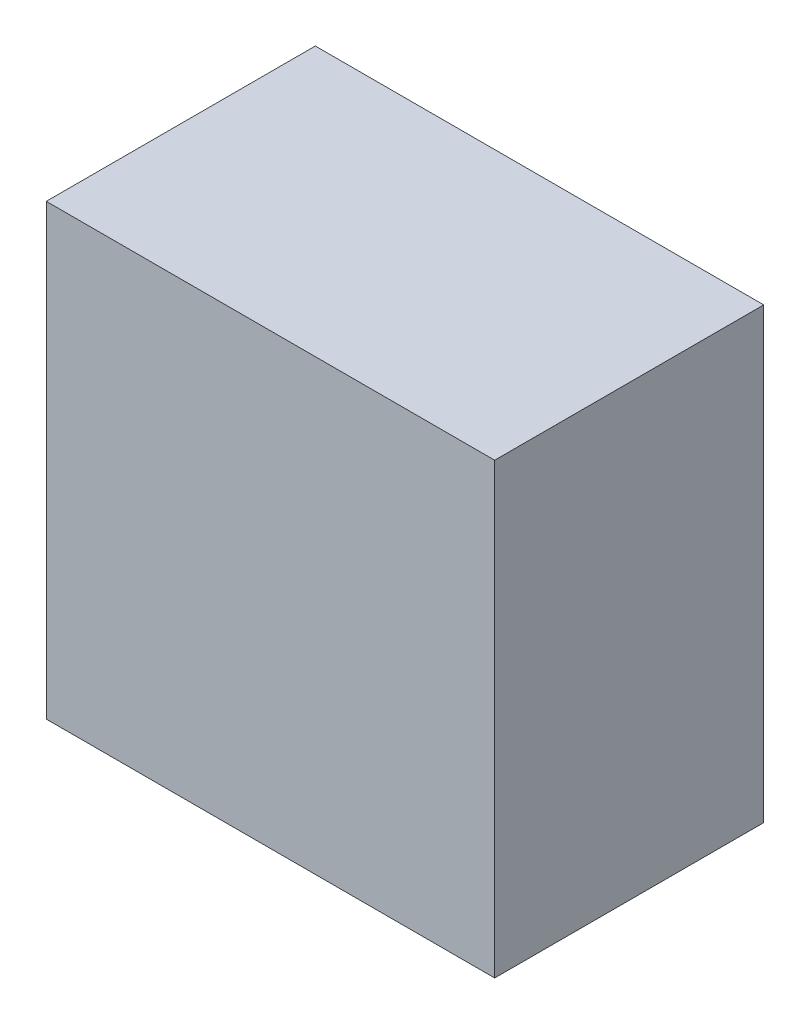
ISO-10303-21;
HEADER;
FILE_DESCRIPTION(('STEP AP214'),'2;1');
FILE_NAME('part.step','',(''),(''),'','','');
FILE_SCHEMA(('AUTOMOTIVE_DESIGN { 1 0 10303 214 1 1 1 1 }'));
ENDSEC;
DATA;
#1=APPLICATION_CONTEXT('core data for automotive mechanical design processes');
#2=APPLICATION_PROTOCOL_DEFINITION('international standard','automotive_design',2000,#1);
#3=PRODUCT_CONTEXT('',#1,'mechanical');
#4=PRODUCT('Part','Part','',(#3));
#5=PRODUCT_RELATED_PRODUCT_CATEGORY('part','',(#4));
#6=PRODUCT_DEFINITION_FORMATION('','',#4);
#7=PRODUCT_DEFINITION_CONTEXT('part definition',#1,'design');
#8=PRODUCT_DEFINITION('design','',#6,#7);
#9=PRODUCT_DEFINITION_SHAPE('','',#8);
#10=(LENGTH_UNIT() NAMED_UNIT(*) SI_UNIT(.MILLI.,.METRE.));
#11=(NAMED_UNIT(*) PLANE_ANGLE_UNIT() SI_UNIT($,.RADIAN.));
#12=(NAMED_UNIT(*) SI_UNIT($,.STERADIAN.) SOLID_ANGLE_UNIT());
#13=UNCERTAINTY_MEASURE_WITH_UNIT(LENGTH_MEASURE(1.E-05),#10,'distance_accuracy_value','');
#14=(GEOMETRIC_REPRESENTATION_CONTEXT(3) GLOBAL_UNCERTAINTY_ASSIGNED_CONTEXT((#13)) GLOBAL_UNIT_ASSIGNED_CONTEXT((#10,
#11,#12)) REPRESENTATION_CONTEXT('',''));
#15=CARTESIAN_POINT('',(0.,0.,0.));
#16=DIRECTION('',(0.,0.,1.));
#17=DIRECTION('',(1.,0.,0.));
#18=AXIS2_PLACEMENT_3D('',#15,#16,#17);
#19=CARTESIAN_POINT('',(0.,0.,0.17999964));
#20=DIRECTION('',(0.,0.,1.));
#21=DIRECTION('',(1.,0.,0.));
#22=AXIS2_PLACEMENT_3D('',#19,#20,#21);
#23=PLANE('',#22);
#24=DIRECTION('',(-1.,0.,0.));
#25=VECTOR('',#24,1.);
#26=CARTESIAN_POINT('',(0.1499997,0.1499997,0.17999964));
#27=LINE('',#26,#25);
#28=CARTESIAN_POINT('',(0.1499997,0.1499997,0.17999964));
#29=VERTEX_POINT('',#28);
#30=CARTESIAN_POINT('',(-0.1499997,0.1499997,0.17999964));
#31=VERTEX_POINT('',#30);
#32=EDGE_CURVE('E86',#29,#31,#27,.T.);
#33=ORIENTED_EDGE('',*,*,#32,.T.);
#34=DIRECTION('',(0.,-1.,0.));
#35=VECTOR('',#34,1.);
#36=CARTESIAN_POINT('',(-0.1499997,0.1499997,0.17999964));
#37=LINE('',#36,#35);
#38=CARTESIAN_POINT('',(-0.1499997,-0.1499997,0.17999964));
#39=VERTEX_POINT('',#38);
#40=EDGE_CURVE('E20',#31,#39,#37,.T.);
#41=ORIENTED_EDGE('',*,*,#40,.T.);
#42=DIRECTION('',(1.,0.,0.));
#43=VECTOR('',#42,1.);
#44=CARTESIAN_POINT('',(-0.1499997,-0.1499997,0.17999964));
#45=LINE('',#44,#43);
#46=CARTESIAN_POINT('',(0.1499997,-0.1499997,0.17999964));
#47=VERTEX_POINT('',#46);
#48=EDGE_CURVE('E77',#39,#47,#45,.T.);
#49=ORIENTED_EDGE('',*,*,#48,.T.);
#50=DIRECTION('',(0.,1.,0.));
#51=VECTOR('',#50,1.);
#52=CARTESIAN_POINT('',(0.1499997,-0.1499997,0.17999964));
#53=LINE('',#52,#51);
#54=EDGE_CURVE('E11',#47,#29,#53,.T.);
#55=ORIENTED_EDGE('',*,*,#54,.T.);
#56=EDGE_LOOP('',(#33,#41,#49,#55));
#57=FACE_BOUND('',#56,.T.);
#58=ADVANCED_FACE('F16',(#57),#23,.T.);
#59=CARTESIAN_POINT('',(0.,0.,0.));
#60=DIRECTION('',(0.,0.,1.));
#61=DIRECTION('',(1.,0.,0.));
#62=AXIS2_PLACEMENT_3D('',#59,#60,#61);
#63=PLANE('',#62);
#64=DIRECTION('',(-1.,0.,0.));
#65=VECTOR('',#64,1.);
#66=CARTESIAN_POINT('',(0.1499997,0.1499997,0.));
#67=LINE('',#66,#65);
#68=CARTESIAN_POINT('',(0.1499997,0.1499997,0.));
#69=VERTEX_POINT('',#68);
#70=CARTESIAN_POINT('',(-0.1499997,0.1499997,0.));
#71=VERTEX_POINT('',#70);
#72=EDGE_CURVE('E105',#69,#71,#67,.T.);
#73=ORIENTED_EDGE('',*,*,#72,.F.);
#74=DIRECTION('',(0.,1.,0.));
#75=VECTOR('',#74,1.);
#76=CARTESIAN_POINT('',(0.1499997,-0.1499997,0.));
#77=LINE('',#76,#75);
#78=CARTESIAN_POINT('',(0.1499997,-0.1499997,0.));
#79=VERTEX_POINT('',#78);
#80=EDGE_CURVE('E27',#79,#69,#77,.T.);
#81=ORIENTED_EDGE('',*,*,#80,.F.);
#82=DIRECTION('',(1.,0.,0.));
#83=VECTOR('',#82,1.);
#84=CARTESIAN_POINT('',(-0.1499997,-0.1499997,0.));
#85=LINE('',#84,#83);
#86=CARTESIAN_POINT('',(-0.1499997,-0.1499997,0.));
#87=VERTEX_POINT('',#86);
#88=EDGE_CURVE('E90',#87,#79,#85,.T.);
#89=ORIENTED_EDGE('',*,*,#88,.F.);
#90=DIRECTION('',(0.,-1.,0.));
#91=VECTOR('',#90,1.);
#92=CARTESIAN_POINT('',(-0.1499997,0.1499997,0.));
#93=LINE('',#92,#91);
#94=EDGE_CURVE('E59',#71,#87,#93,.T.);
#95=ORIENTED_EDGE('',*,*,#94,.F.);
#96=EDGE_LOOP('',(#73,#81,#89,#95));
#97=FACE_BOUND('',#96,.T.);
#98=ADVANCED_FACE('F125',(#97),#63,.F.);
#99=CARTESIAN_POINT('',(0.1499997,-0.1499997,0.));
#100=DIRECTION('',(-1.,0.,0.));
#101=DIRECTION('',(0.,0.,1.));
#102=AXIS2_PLACEMENT_3D('',#99,#100,#101);
#103=PLANE('',#102);
#104=DIRECTION('',(0.,0.,1.));
#105=VECTOR('',#104,1.);
#106=CARTESIAN_POINT('',(0.1499997,-0.1499997,0.));
#107=LINE('',#106,#105);
#108=EDGE_CURVE('E83',#79,#47,#107,.T.);
#109=ORIENTED_EDGE('',*,*,#108,.F.);
#110=ORIENTED_EDGE('',*,*,#80,.T.);
#111=DIRECTION('',(0.,0.,1.));
#112=VECTOR('',#111,1.);
#113=CARTESIAN_POINT('',(0.1499997,0.1499997,0.));
#114=LINE('',#113,#112);
#115=EDGE_CURVE('E110',#69,#29,#114,.T.);
#116=ORIENTED_EDGE('',*,*,#115,.T.);
#117=ORIENTED_EDGE('',*,*,#54,.F.);
#118=EDGE_LOOP('',(#109,#110,#116,#117));
#119=FACE_BOUND('',#118,.T.);
#120=ADVANCED_FACE('F122',(#119),#103,.F.);
#121=CARTESIAN_POINT('',(-0.1499997,-0.1499997,0.));
#122=DIRECTION('',(0.,1.,0.));
#123=DIRECTION('',(1.,0.,0.));
#124=AXIS2_PLACEMENT_3D('',#121,#122,#123);
#125=PLANE('',#124);
#126=DIRECTION('',(0.,0.,1.));
#127=VECTOR('',#126,1.);
#128=CARTESIAN_POINT('',(-0.1499997,-0.1499997,0.));
#129=LINE('',#128,#127);
#130=EDGE_CURVE('E82',#87,#39,#129,.T.);
#131=ORIENTED_EDGE('',*,*,#130,.F.);
#132=ORIENTED_EDGE('',*,*,#88,.T.);
#133=ORIENTED_EDGE('',*,*,#108,.T.);
#134=ORIENTED_EDGE('',*,*,#48,.F.);
#135=EDGE_LOOP('',(#131,#132,#133,#134));
#136=FACE_BOUND('',#135,.T.);
#137=ADVANCED_FACE('F79',(#136),#125,.F.);
#138=CARTESIAN_POINT('',(-0.1499997,0.1499997,0.));
#139=DIRECTION('',(1.,0.,0.));
#140=DIRECTION('',(0.,1.,0.));
#141=AXIS2_PLACEMENT_3D('',#138,#139,#140);
#142=PLANE('',#141);
#143=DIRECTION('',(0.,0.,1.));
#144=VECTOR('',#143,1.);
#145=CARTESIAN_POINT('',(-0.1499997,0.1499997,0.));
#146=LINE('',#145,#144);
#147=EDGE_CURVE('E102',#71,#31,#146,.T.);
#148=ORIENTED_EDGE('',*,*,#147,.F.);
#149=ORIENTED_EDGE('',*,*,#94,.T.);
#150=ORIENTED_EDGE('',*,*,#130,.T.);
#151=ORIENTED_EDGE('',*,*,#40,.F.);
#152=EDGE_LOOP('',(#148,#149,#150,#151));
#153=FACE_BOUND('',#152,.T.);
#154=ADVANCED_FACE('F18',(#153),#142,.F.);
#155=CARTESIAN_POINT('',(0.1499997,0.1499997,0.));
#156=DIRECTION('',(0.,-1.,0.));
#157=DIRECTION('',(0.,0.,-1.));
#158=AXIS2_PLACEMENT_3D('',#155,#156,#157);
#159=PLANE('',#158);
#160=ORIENTED_EDGE('',*,*,#115,.F.);
#161=ORIENTED_EDGE('',*,*,#72,.T.);
#162=ORIENTED_EDGE('',*,*,#147,.T.);
#163=ORIENTED_EDGE('',*,*,#32,.F.);
#164=EDGE_LOOP('',(#160,#161,#162,#163));
#165=FACE_BOUND('',#164,.T.);
#166=ADVANCED_FACE('F124',(#165),#159,.F.);
#167=CLOSED_SHELL('',(#58,#98,#120,#137,#154,#166));
#168=MANIFOLD_SOLID_BREP('B1',#167);
#169=ADVANCED_BREP_SHAPE_REPRESENTATION('',(#18,#168),#14);
#170=SHAPE_DEFINITION_REPRESENTATION(#9,#169);
ENDSEC;
END-ISO-10303-21;
